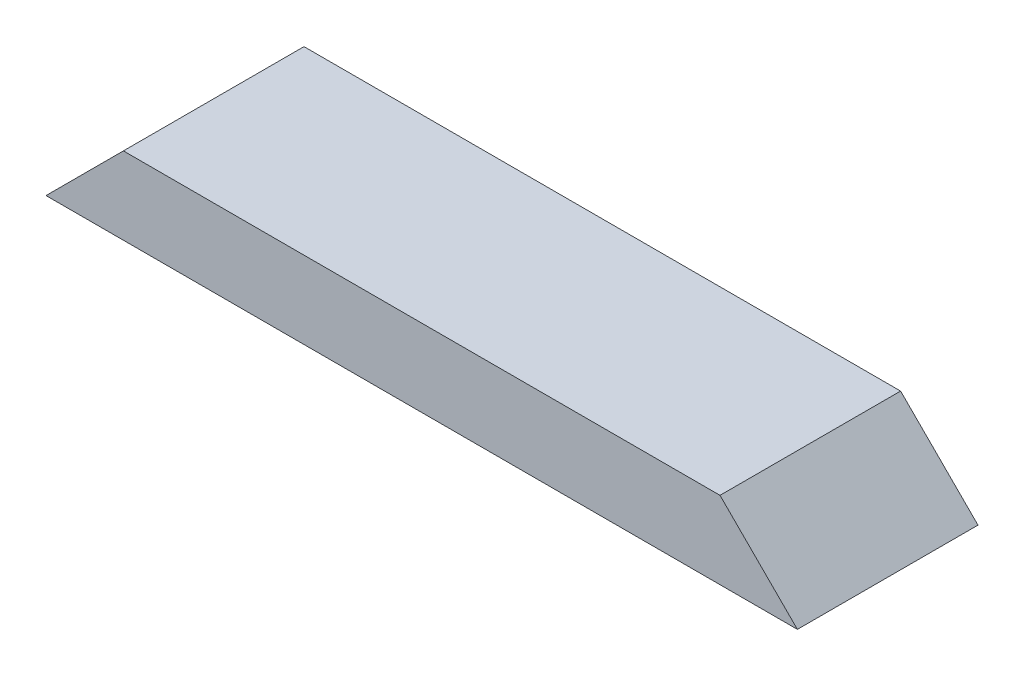
ISO-10303-21;
HEADER;
FILE_DESCRIPTION(('STEP AP214'),'2;1');
FILE_NAME('part.step','',(''),(''),'','','');
FILE_SCHEMA(('AUTOMOTIVE_DESIGN { 1 0 10303 214 1 1 1 1 }'));
ENDSEC;
DATA;
#1=APPLICATION_CONTEXT('core data for automotive mechanical design processes');
#2=APPLICATION_PROTOCOL_DEFINITION('international standard','automotive_design',2000,#1);
#3=PRODUCT_CONTEXT('',#1,'mechanical');
#4=PRODUCT('Part','Part','',(#3));
#5=PRODUCT_RELATED_PRODUCT_CATEGORY('part','',(#4));
#6=PRODUCT_DEFINITION_FORMATION('','',#4);
#7=PRODUCT_DEFINITION_CONTEXT('part definition',#1,'design');
#8=PRODUCT_DEFINITION('design','',#6,#7);
#9=PRODUCT_DEFINITION_SHAPE('','',#8);
#10=(LENGTH_UNIT() NAMED_UNIT(*) SI_UNIT(.MILLI.,.METRE.));
#11=(NAMED_UNIT(*) PLANE_ANGLE_UNIT() SI_UNIT($,.RADIAN.));
#12=(NAMED_UNIT(*) SI_UNIT($,.STERADIAN.) SOLID_ANGLE_UNIT());
#13=UNCERTAINTY_MEASURE_WITH_UNIT(LENGTH_MEASURE(1.E-05),#10,'distance_accuracy_value','');
#14=(GEOMETRIC_REPRESENTATION_CONTEXT(3) GLOBAL_UNCERTAINTY_ASSIGNED_CONTEXT((#13)) GLOBAL_UNIT_ASSIGNED_CONTEXT((#10,
#11,#12)) REPRESENTATION_CONTEXT('',''));
#15=CARTESIAN_POINT('',(0.,0.,0.));
#16=DIRECTION('',(0.,0.,1.));
#17=DIRECTION('',(1.,0.,0.));
#18=AXIS2_PLACEMENT_3D('',#15,#16,#17);
#19=CARTESIAN_POINT('',(0.,38.1,0.));
#20=DIRECTION('',(0.,0.,-1.));
#21=DIRECTION('',(-1.,0.,0.));
#22=AXIS2_PLACEMENT_3D('',#19,#20,#21);
#23=PLANE('',#22);
#24=DIRECTION('',(1.,0.,0.));
#25=VECTOR('',#24,1.);
#26=CARTESIAN_POINT('',(0.,38.1,0.));
#27=LINE('',#26,#25);
#28=CARTESIAN_POINT('',(38.1,38.1,0.));
#29=VERTEX_POINT('',#28);
#30=CARTESIAN_POINT('',(331.7875,38.1,0.));
#31=VERTEX_POINT('',#30);
#32=EDGE_CURVE('E46',#29,#31,#27,.T.);
#33=ORIENTED_EDGE('',*,*,#32,.F.);
#34=DIRECTION('',(0.707106781186547,0.707106781186547,0.));
#35=VECTOR('',#34,1.);
#36=CARTESIAN_POINT('',(0.,0.,0.));
#37=LINE('',#36,#35);
#38=CARTESIAN_POINT('',(0.,0.,0.));
#39=VERTEX_POINT('',#38);
#40=EDGE_CURVE('E81',#39,#29,#37,.T.);
#41=ORIENTED_EDGE('',*,*,#40,.F.);
#42=DIRECTION('',(1.,0.,0.));
#43=VECTOR('',#42,1.);
#44=CARTESIAN_POINT('',(0.,0.,0.));
#45=LINE('',#44,#43);
#46=CARTESIAN_POINT('',(369.8875,0.,0.));
#47=VERTEX_POINT('',#46);
#48=EDGE_CURVE('E86',#39,#47,#45,.T.);
#49=ORIENTED_EDGE('',*,*,#48,.T.);
#50=DIRECTION('',(0.707106781186551,-0.707106781186544,0.));
#51=VECTOR('',#50,1.);
#52=CARTESIAN_POINT('',(369.8875,0.,0.));
#53=LINE('',#52,#51);
#54=EDGE_CURVE('E62',#31,#47,#53,.T.);
#55=ORIENTED_EDGE('',*,*,#54,.F.);
#56=EDGE_LOOP('',(#33,#41,#49,#55));
#57=FACE_BOUND('',#56,.T.);
#58=ADVANCED_FACE('F38',(#57),#23,.F.);
#59=CARTESIAN_POINT('',(0.,38.1,-88.9));
#60=DIRECTION('',(0.,0.,1.));
#61=DIRECTION('',(1.,0.,0.));
#62=AXIS2_PLACEMENT_3D('',#59,#60,#61);
#63=PLANE('',#62);
#64=DIRECTION('',(-1.,0.,0.));
#65=VECTOR('',#64,1.);
#66=CARTESIAN_POINT('',(0.,0.,-88.9));
#67=LINE('',#66,#65);
#68=CARTESIAN_POINT('',(369.8875,0.,-88.9));
#69=VERTEX_POINT('',#68);
#70=CARTESIAN_POINT('',(0.,0.,-88.9));
#71=VERTEX_POINT('',#70);
#72=EDGE_CURVE('E41',#69,#71,#67,.T.);
#73=ORIENTED_EDGE('',*,*,#72,.T.);
#74=DIRECTION('',(0.707106781186547,0.707106781186547,0.));
#75=VECTOR('',#74,1.);
#76=CARTESIAN_POINT('',(0.,0.,-88.9));
#77=LINE('',#76,#75);
#78=CARTESIAN_POINT('',(38.1,38.1,-88.9));
#79=VERTEX_POINT('',#78);
#80=EDGE_CURVE('E54',#71,#79,#77,.T.);
#81=ORIENTED_EDGE('',*,*,#80,.T.);
#82=DIRECTION('',(-1.,0.,0.));
#83=VECTOR('',#82,1.);
#84=CARTESIAN_POINT('',(0.,38.1,-88.9));
#85=LINE('',#84,#83);
#86=CARTESIAN_POINT('',(331.7875,38.1,-88.9));
#87=VERTEX_POINT('',#86);
#88=EDGE_CURVE('E11',#87,#79,#85,.T.);
#89=ORIENTED_EDGE('',*,*,#88,.F.);
#90=DIRECTION('',(0.707106781186551,-0.707106781186544,0.));
#91=VECTOR('',#90,1.);
#92=CARTESIAN_POINT('',(369.8875,0.,-88.9));
#93=LINE('',#92,#91);
#94=EDGE_CURVE('E99',#87,#69,#93,.T.);
#95=ORIENTED_EDGE('',*,*,#94,.T.);
#96=EDGE_LOOP('',(#73,#81,#89,#95));
#97=FACE_BOUND('',#96,.T.);
#98=ADVANCED_FACE('F108',(#97),#63,.F.);
#99=CARTESIAN_POINT('',(0.,38.1,0.));
#100=DIRECTION('',(0.,-1.,0.));
#101=DIRECTION('',(0.,0.,-1.));
#102=AXIS2_PLACEMENT_3D('',#99,#100,#101);
#103=PLANE('',#102);
#104=ORIENTED_EDGE('',*,*,#88,.T.);
#105=DIRECTION('',(0.,0.,1.));
#106=VECTOR('',#105,1.);
#107=CARTESIAN_POINT('',(38.1,38.1,-88.9));
#108=LINE('',#107,#106);
#109=EDGE_CURVE('E87',#79,#29,#108,.T.);
#110=ORIENTED_EDGE('',*,*,#109,.T.);
#111=ORIENTED_EDGE('',*,*,#32,.T.);
#112=DIRECTION('',(0.,0.,1.));
#113=VECTOR('',#112,1.);
#114=CARTESIAN_POINT('',(331.7875,38.1,-88.9));
#115=LINE('',#114,#113);
#116=EDGE_CURVE('E102',#87,#31,#115,.T.);
#117=ORIENTED_EDGE('',*,*,#116,.F.);
#118=EDGE_LOOP('',(#104,#110,#111,#117));
#119=FACE_BOUND('',#118,.T.);
#120=ADVANCED_FACE('F111',(#119),#103,.F.);
#121=CARTESIAN_POINT('',(0.,0.,0.));
#122=DIRECTION('',(0.,-1.,0.));
#123=DIRECTION('',(0.,0.,-1.));
#124=AXIS2_PLACEMENT_3D('',#121,#122,#123);
#125=PLANE('',#124);
#126=DIRECTION('',(0.,0.,1.));
#127=VECTOR('',#126,1.);
#128=CARTESIAN_POINT('',(0.,0.,0.));
#129=LINE('',#128,#127);
#130=EDGE_CURVE('E78',#71,#39,#129,.T.);
#131=ORIENTED_EDGE('',*,*,#130,.F.);
#132=ORIENTED_EDGE('',*,*,#72,.F.);
#133=DIRECTION('',(0.,0.,-1.));
#134=VECTOR('',#133,1.);
#135=CARTESIAN_POINT('',(369.8875,0.,0.));
#136=LINE('',#135,#134);
#137=EDGE_CURVE('E95',#47,#69,#136,.T.);
#138=ORIENTED_EDGE('',*,*,#137,.F.);
#139=ORIENTED_EDGE('',*,*,#48,.F.);
#140=EDGE_LOOP('',(#131,#132,#138,#139));
#141=FACE_BOUND('',#140,.T.);
#142=ADVANCED_FACE('F94',(#141),#125,.T.);
#143=CARTESIAN_POINT('',(369.8875,0.,-88.9));
#144=DIRECTION('',(-0.707106781186544,-0.707106781186551,0.));
#145=DIRECTION('',(0.707106781186551,-0.707106781186544,0.));
#146=AXIS2_PLACEMENT_3D('',#143,#144,#145);
#147=PLANE('',#146);
#148=ORIENTED_EDGE('',*,*,#54,.T.);
#149=ORIENTED_EDGE('',*,*,#137,.T.);
#150=ORIENTED_EDGE('',*,*,#94,.F.);
#151=ORIENTED_EDGE('',*,*,#116,.T.);
#152=EDGE_LOOP('',(#148,#149,#150,#151));
#153=FACE_BOUND('',#152,.T.);
#154=ADVANCED_FACE('F112',(#153),#147,.F.);
#155=CARTESIAN_POINT('',(0.,0.,-88.9));
#156=DIRECTION('',(0.707106781186547,-0.707106781186547,0.));
#157=DIRECTION('',(0.707106781186548,0.707106781186548,0.));
#158=AXIS2_PLACEMENT_3D('',#155,#156,#157);
#159=PLANE('',#158);
#160=ORIENTED_EDGE('',*,*,#40,.T.);
#161=ORIENTED_EDGE('',*,*,#109,.F.);
#162=ORIENTED_EDGE('',*,*,#80,.F.);
#163=ORIENTED_EDGE('',*,*,#130,.T.);
#164=EDGE_LOOP('',(#160,#161,#162,#163));
#165=FACE_BOUND('',#164,.T.);
#166=ADVANCED_FACE('F80',(#165),#159,.F.);
#167=CLOSED_SHELL('',(#58,#98,#120,#142,#154,#166));
#168=MANIFOLD_SOLID_BREP('B2',#167);
#169=ADVANCED_BREP_SHAPE_REPRESENTATION('',(#18,#168),#14);
#170=SHAPE_DEFINITION_REPRESENTATION(#9,#169);
ENDSEC;
END-ISO-10303-21;
